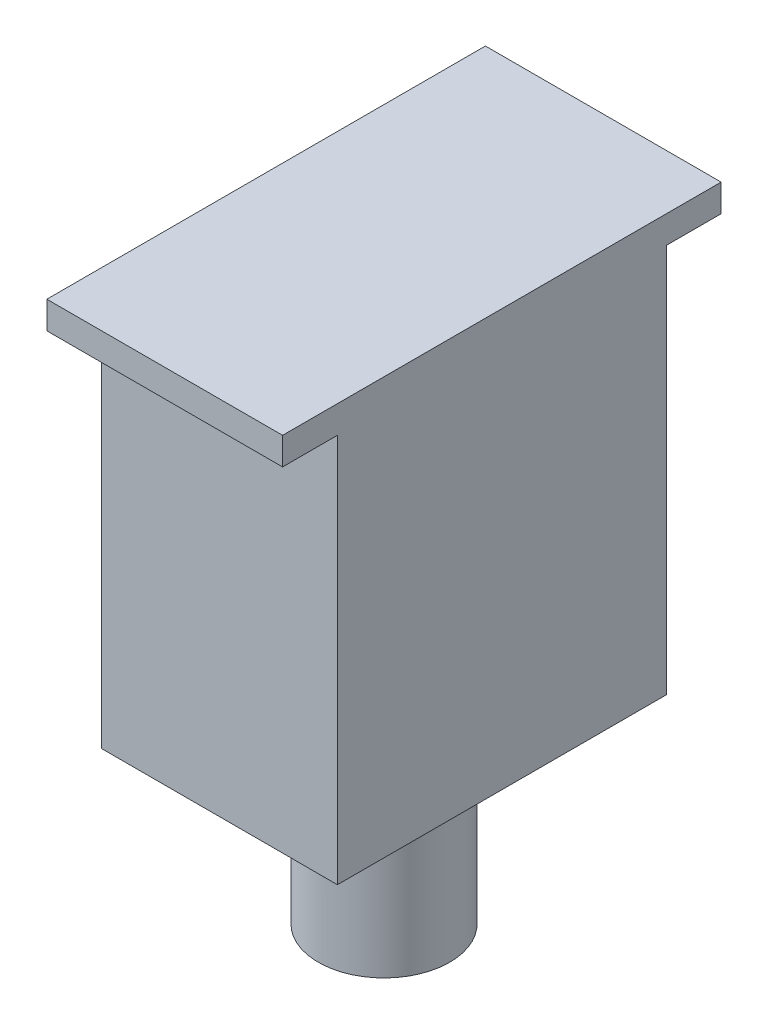
ISO-10303-21;
HEADER;
FILE_DESCRIPTION(('STEP AP214'),'2;1');
FILE_NAME('part.step','',(''),(''),'','','');
FILE_SCHEMA(('AUTOMOTIVE_DESIGN { 1 0 10303 214 1 1 1 1 }'));
ENDSEC;
DATA;
#1=APPLICATION_CONTEXT('core data for automotive mechanical design processes');
#2=APPLICATION_PROTOCOL_DEFINITION('international standard','automotive_design',2000,#1);
#3=PRODUCT_CONTEXT('',#1,'mechanical');
#4=PRODUCT('Part','Part','',(#3));
#5=PRODUCT_RELATED_PRODUCT_CATEGORY('part','',(#4));
#6=PRODUCT_DEFINITION_FORMATION('','',#4);
#7=PRODUCT_DEFINITION_CONTEXT('part definition',#1,'design');
#8=PRODUCT_DEFINITION('design','',#6,#7);
#9=PRODUCT_DEFINITION_SHAPE('','',#8);
#10=(LENGTH_UNIT() NAMED_UNIT(*) SI_UNIT(.MILLI.,.METRE.));
#11=(NAMED_UNIT(*) PLANE_ANGLE_UNIT() SI_UNIT($,.RADIAN.));
#12=(NAMED_UNIT(*) SI_UNIT($,.STERADIAN.) SOLID_ANGLE_UNIT());
#13=UNCERTAINTY_MEASURE_WITH_UNIT(LENGTH_MEASURE(1.E-05),#10,'distance_accuracy_value','');
#14=(GEOMETRIC_REPRESENTATION_CONTEXT(3) GLOBAL_UNCERTAINTY_ASSIGNED_CONTEXT((#13)) GLOBAL_UNIT_ASSIGNED_CONTEXT((#10,
#11,#12)) REPRESENTATION_CONTEXT('',''));
#15=CARTESIAN_POINT('',(0.,0.,0.));
#16=DIRECTION('',(0.,0.,1.));
#17=DIRECTION('',(1.,0.,0.));
#18=AXIS2_PLACEMENT_3D('',#15,#16,#17);
#19=CARTESIAN_POINT('',(465.,-7.6,59.5));
#20=DIRECTION('',(0.,-1.,0.));
#21=DIRECTION('',(0.,0.,-1.));
#22=AXIS2_PLACEMENT_3D('',#19,#20,#21);
#23=PLANE('',#22);
#24=DIRECTION('',(-1.,0.,0.));
#25=VECTOR('',#24,1.);
#26=CARTESIAN_POINT('',(486.5,-7.6,89.5));
#27=LINE('',#26,#25);
#28=CARTESIAN_POINT('',(486.5,-7.6,89.5));
#29=VERTEX_POINT('',#28);
#30=CARTESIAN_POINT('',(443.5,-7.6,89.5));
#31=VERTEX_POINT('',#30);
#32=EDGE_CURVE('E34',#29,#31,#27,.T.);
#33=ORIENTED_EDGE('',*,*,#32,.F.);
#34=DIRECTION('',(0.,0.,1.));
#35=VECTOR('',#34,1.);
#36=CARTESIAN_POINT('',(486.5,-7.6,19.5));
#37=LINE('',#36,#35);
#38=CARTESIAN_POINT('',(486.5,-7.6,99.5));
#39=VERTEX_POINT('',#38);
#40=EDGE_CURVE('E131',#29,#39,#37,.T.);
#41=ORIENTED_EDGE('',*,*,#40,.T.);
#42=DIRECTION('',(-1.,0.,0.));
#43=VECTOR('',#42,1.);
#44=CARTESIAN_POINT('',(486.5,-7.6,99.5));
#45=LINE('',#44,#43);
#46=CARTESIAN_POINT('',(443.5,-7.6,99.5));
#47=VERTEX_POINT('',#46);
#48=EDGE_CURVE('E100',#39,#47,#45,.T.);
#49=ORIENTED_EDGE('',*,*,#48,.T.);
#50=DIRECTION('',(0.,0.,-1.));
#51=VECTOR('',#50,1.);
#52=CARTESIAN_POINT('',(443.5,-7.6,99.5));
#53=LINE('',#52,#51);
#54=EDGE_CURVE('E117',#47,#31,#53,.T.);
#55=ORIENTED_EDGE('',*,*,#54,.T.);
#56=EDGE_LOOP('',(#33,#41,#49,#55));
#57=FACE_BOUND('',#56,.T.);
#58=ADVANCED_FACE('F17',(#57),#23,.T.);
#59=CARTESIAN_POINT('',(443.5,-7.6,99.5));
#60=DIRECTION('',(1.,0.,0.));
#61=DIRECTION('',(0.,0.,-1.));
#62=AXIS2_PLACEMENT_3D('',#59,#60,#61);
#63=PLANE('',#62);
#64=DIRECTION('',(0.,0.,-1.));
#65=VECTOR('',#64,1.);
#66=CARTESIAN_POINT('',(443.5,-2.6,99.5));
#67=LINE('',#66,#65);
#68=CARTESIAN_POINT('',(443.5,-2.6,99.5));
#69=VERTEX_POINT('',#68);
#70=CARTESIAN_POINT('',(443.5,-2.6,19.5));
#71=VERTEX_POINT('',#70);
#72=EDGE_CURVE('E90',#69,#71,#67,.T.);
#73=ORIENTED_EDGE('',*,*,#72,.T.);
#74=DIRECTION('',(0.,1.,0.));
#75=VECTOR('',#74,1.);
#76=CARTESIAN_POINT('',(443.5,-7.6,19.5));
#77=LINE('',#76,#75);
#78=CARTESIAN_POINT('',(443.5,-7.6,19.5));
#79=VERTEX_POINT('',#78);
#80=EDGE_CURVE('E11',#79,#71,#77,.T.);
#81=ORIENTED_EDGE('',*,*,#80,.F.);
#82=CARTESIAN_POINT('',(443.5,-7.6,29.5));
#83=VERTEX_POINT('',#82);
#84=EDGE_CURVE('E94',#83,#79,#53,.T.);
#85=ORIENTED_EDGE('',*,*,#84,.F.);
#86=DIRECTION('',(0.,1.,0.));
#87=VECTOR('',#86,1.);
#88=CARTESIAN_POINT('',(443.5,-31.1,29.5));
#89=LINE('',#88,#87);
#90=CARTESIAN_POINT('',(443.5,-78.6,29.5));
#91=VERTEX_POINT('',#90);
#92=EDGE_CURVE('E114',#91,#83,#89,.T.);
#93=ORIENTED_EDGE('',*,*,#92,.F.);
#94=DIRECTION('',(0.,0.,-1.));
#95=VECTOR('',#94,1.);
#96=CARTESIAN_POINT('',(443.5,-78.6,89.5));
#97=LINE('',#96,#95);
#98=CARTESIAN_POINT('',(443.5,-78.6,89.5));
#99=VERTEX_POINT('',#98);
#100=EDGE_CURVE('E169',#99,#91,#97,.T.);
#101=ORIENTED_EDGE('',*,*,#100,.F.);
#102=DIRECTION('',(0.,1.,0.));
#103=VECTOR('',#102,1.);
#104=CARTESIAN_POINT('',(443.5,-31.1,89.5));
#105=LINE('',#104,#103);
#106=EDGE_CURVE('E151',#99,#31,#105,.T.);
#107=ORIENTED_EDGE('',*,*,#106,.T.);
#108=ORIENTED_EDGE('',*,*,#54,.F.);
#109=DIRECTION('',(0.,1.,0.));
#110=VECTOR('',#109,1.);
#111=CARTESIAN_POINT('',(443.5,-7.6,99.5));
#112=LINE('',#111,#110);
#113=EDGE_CURVE('E102',#47,#69,#112,.T.);
#114=ORIENTED_EDGE('',*,*,#113,.T.);
#115=EDGE_LOOP('',(#73,#81,#85,#93,#101,#107,#108,#114));
#116=FACE_BOUND('',#115,.T.);
#117=ADVANCED_FACE('F19',(#116),#63,.F.);
#118=CARTESIAN_POINT('',(443.5,-7.6,19.5));
#119=DIRECTION('',(0.,0.,1.));
#120=DIRECTION('',(1.,0.,0.));
#121=AXIS2_PLACEMENT_3D('',#118,#119,#120);
#122=PLANE('',#121);
#123=DIRECTION('',(1.,0.,0.));
#124=VECTOR('',#123,1.);
#125=CARTESIAN_POINT('',(443.5,-2.6,19.5));
#126=LINE('',#125,#124);
#127=CARTESIAN_POINT('',(486.5,-2.6,19.5));
#128=VERTEX_POINT('',#127);
#129=EDGE_CURVE('E108',#71,#128,#126,.T.);
#130=ORIENTED_EDGE('',*,*,#129,.T.);
#131=DIRECTION('',(0.,1.,0.));
#132=VECTOR('',#131,1.);
#133=CARTESIAN_POINT('',(486.5,-7.6,19.5));
#134=LINE('',#133,#132);
#135=CARTESIAN_POINT('',(486.5,-7.6,19.5));
#136=VERTEX_POINT('',#135);
#137=EDGE_CURVE('E26',#136,#128,#134,.T.);
#138=ORIENTED_EDGE('',*,*,#137,.F.);
#139=DIRECTION('',(1.,0.,0.));
#140=VECTOR('',#139,1.);
#141=CARTESIAN_POINT('',(443.5,-7.6,19.5));
#142=LINE('',#141,#140);
#143=EDGE_CURVE('E119',#79,#136,#142,.T.);
#144=ORIENTED_EDGE('',*,*,#143,.F.);
#145=ORIENTED_EDGE('',*,*,#80,.T.);
#146=EDGE_LOOP('',(#130,#138,#144,#145));
#147=FACE_BOUND('',#146,.T.);
#148=ADVANCED_FACE('F137',(#147),#122,.F.);
#149=CARTESIAN_POINT('',(486.5,-7.6,19.5));
#150=DIRECTION('',(-1.,0.,0.));
#151=DIRECTION('',(0.,0.,1.));
#152=AXIS2_PLACEMENT_3D('',#149,#150,#151);
#153=PLANE('',#152);
#154=DIRECTION('',(0.,0.,1.));
#155=VECTOR('',#154,1.);
#156=CARTESIAN_POINT('',(486.5,-2.6,19.5));
#157=LINE('',#156,#155);
#158=CARTESIAN_POINT('',(486.5,-2.6,99.5));
#159=VERTEX_POINT('',#158);
#160=EDGE_CURVE('E87',#128,#159,#157,.T.);
#161=ORIENTED_EDGE('',*,*,#160,.T.);
#162=DIRECTION('',(0.,1.,0.));
#163=VECTOR('',#162,1.);
#164=CARTESIAN_POINT('',(486.5,-7.6,99.5));
#165=LINE('',#164,#163);
#166=EDGE_CURVE('E98',#39,#159,#165,.T.);
#167=ORIENTED_EDGE('',*,*,#166,.F.);
#168=ORIENTED_EDGE('',*,*,#40,.F.);
#169=DIRECTION('',(0.,1.,0.));
#170=VECTOR('',#169,1.);
#171=CARTESIAN_POINT('',(486.5,-31.1,89.5));
#172=LINE('',#171,#170);
#173=CARTESIAN_POINT('',(486.5,-78.6,89.5));
#174=VERTEX_POINT('',#173);
#175=EDGE_CURVE('E146',#174,#29,#172,.T.);
#176=ORIENTED_EDGE('',*,*,#175,.F.);
#177=DIRECTION('',(0.,0.,1.));
#178=VECTOR('',#177,1.);
#179=CARTESIAN_POINT('',(486.5,-78.6,29.5));
#180=LINE('',#179,#178);
#181=CARTESIAN_POINT('',(486.5,-78.6,29.5));
#182=VERTEX_POINT('',#181);
#183=EDGE_CURVE('E142',#182,#174,#180,.T.);
#184=ORIENTED_EDGE('',*,*,#183,.F.);
#185=DIRECTION('',(0.,1.,0.));
#186=VECTOR('',#185,1.);
#187=CARTESIAN_POINT('',(486.5,-31.1,29.5));
#188=LINE('',#187,#186);
#189=CARTESIAN_POINT('',(486.5,-7.6,29.5));
#190=VERTEX_POINT('',#189);
#191=EDGE_CURVE('E140',#182,#190,#188,.T.);
#192=ORIENTED_EDGE('',*,*,#191,.T.);
#193=EDGE_CURVE('E125',#136,#190,#37,.T.);
#194=ORIENTED_EDGE('',*,*,#193,.F.);
#195=ORIENTED_EDGE('',*,*,#137,.T.);
#196=EDGE_LOOP('',(#161,#167,#168,#176,#184,#192,#194,#195));
#197=FACE_BOUND('',#196,.T.);
#198=ADVANCED_FACE('F105',(#197),#153,.F.);
#199=CARTESIAN_POINT('',(486.5,-7.6,99.5));
#200=DIRECTION('',(0.,0.,-1.));
#201=DIRECTION('',(-1.,0.,0.));
#202=AXIS2_PLACEMENT_3D('',#199,#200,#201);
#203=PLANE('',#202);
#204=DIRECTION('',(-1.,0.,0.));
#205=VECTOR('',#204,1.);
#206=CARTESIAN_POINT('',(486.5,-2.6,99.5));
#207=LINE('',#206,#205);
#208=EDGE_CURVE('E83',#159,#69,#207,.T.);
#209=ORIENTED_EDGE('',*,*,#208,.T.);
#210=ORIENTED_EDGE('',*,*,#113,.F.);
#211=ORIENTED_EDGE('',*,*,#48,.F.);
#212=ORIENTED_EDGE('',*,*,#166,.T.);
#213=EDGE_LOOP('',(#209,#210,#211,#212));
#214=FACE_BOUND('',#213,.T.);
#215=ADVANCED_FACE('F99',(#214),#203,.F.);
#216=DIRECTION('',(1.,0.,0.));
#217=VECTOR('',#216,1.);
#218=CARTESIAN_POINT('',(443.5,-7.6,29.5));
#219=LINE('',#218,#217);
#220=EDGE_CURVE('E42',#83,#190,#219,.T.);
#221=ORIENTED_EDGE('',*,*,#220,.F.);
#222=ORIENTED_EDGE('',*,*,#84,.T.);
#223=ORIENTED_EDGE('',*,*,#143,.T.);
#224=ORIENTED_EDGE('',*,*,#193,.T.);
#225=EDGE_LOOP('',(#221,#222,#223,#224));
#226=FACE_BOUND('',#225,.T.);
#227=ADVANCED_FACE('F134',(#226),#23,.T.);
#228=CARTESIAN_POINT('',(443.5,-31.1,29.5));
#229=DIRECTION('',(0.,0.,1.));
#230=DIRECTION('',(1.,0.,0.));
#231=AXIS2_PLACEMENT_3D('',#228,#229,#230);
#232=PLANE('',#231);
#233=ORIENTED_EDGE('',*,*,#220,.T.);
#234=ORIENTED_EDGE('',*,*,#191,.F.);
#235=DIRECTION('',(1.,0.,0.));
#236=VECTOR('',#235,1.);
#237=CARTESIAN_POINT('',(443.5,-78.6,29.5));
#238=LINE('',#237,#236);
#239=EDGE_CURVE('E172',#91,#182,#238,.T.);
#240=ORIENTED_EDGE('',*,*,#239,.F.);
#241=ORIENTED_EDGE('',*,*,#92,.T.);
#242=EDGE_LOOP('',(#233,#234,#240,#241));
#243=FACE_BOUND('',#242,.T.);
#244=ADVANCED_FACE('F202',(#243),#232,.F.);
#245=CARTESIAN_POINT('',(486.5,-31.1,89.5));
#246=DIRECTION('',(0.,0.,-1.));
#247=DIRECTION('',(-1.,0.,0.));
#248=AXIS2_PLACEMENT_3D('',#245,#246,#247);
#249=PLANE('',#248);
#250=ORIENTED_EDGE('',*,*,#32,.T.);
#251=ORIENTED_EDGE('',*,*,#106,.F.);
#252=DIRECTION('',(-1.,0.,0.));
#253=VECTOR('',#252,1.);
#254=CARTESIAN_POINT('',(486.5,-78.6,89.5));
#255=LINE('',#254,#253);
#256=EDGE_CURVE('E166',#174,#99,#255,.T.);
#257=ORIENTED_EDGE('',*,*,#256,.F.);
#258=ORIENTED_EDGE('',*,*,#175,.T.);
#259=EDGE_LOOP('',(#250,#251,#257,#258));
#260=FACE_BOUND('',#259,.T.);
#261=ADVANCED_FACE('F207',(#260),#249,.F.);
#262=CARTESIAN_POINT('',(465.,-78.6,59.5));
#263=DIRECTION('',(0.,-1.,0.));
#264=DIRECTION('',(1.,0.,0.));
#265=AXIS2_PLACEMENT_3D('',#262,#263,#264);
#266=PLANE('',#265);
#267=CARTESIAN_POINT('',(465.,-78.6,59.5));
#268=DIRECTION('',(0.,-1.,0.));
#269=DIRECTION('',(1.,0.,0.));
#270=AXIS2_PLACEMENT_3D('',#267,#268,#269);
#271=CIRCLE('',#270,12.);
#272=CARTESIAN_POINT('',(477.,-78.6,59.5));
#273=VERTEX_POINT('',#272);
#274=EDGE_CURVE('E163',#273,#273,#271,.T.);
#275=ORIENTED_EDGE('',*,*,#274,.F.);
#276=EDGE_LOOP('',(#275));
#277=FACE_BOUND('',#276,.T.);
#278=ORIENTED_EDGE('',*,*,#256,.T.);
#279=ORIENTED_EDGE('',*,*,#100,.T.);
#280=ORIENTED_EDGE('',*,*,#239,.T.);
#281=ORIENTED_EDGE('',*,*,#183,.T.);
#282=EDGE_LOOP('',(#278,#279,#280,#281));
#283=FACE_BOUND('',#282,.T.);
#284=ADVANCED_FACE('F191',(#277,#283),#266,.T.);
#285=CARTESIAN_POINT('',(465.,-110.6,59.5));
#286=DIRECTION('',(0.,1.,0.));
#287=DIRECTION('',(-1.,0.,0.));
#288=AXIS2_PLACEMENT_3D('',#285,#286,#287);
#289=CYLINDRICAL_SURFACE('',#288,12.);
#290=CARTESIAN_POINT('',(465.,-110.6,59.5));
#291=DIRECTION('',(0.,1.,0.));
#292=DIRECTION('',(0.,0.,-1.));
#293=AXIS2_PLACEMENT_3D('',#290,#291,#292);
#294=CIRCLE('',#293,12.);
#295=CARTESIAN_POINT('',(465.,-110.6,47.5));
#296=VERTEX_POINT('',#295);
#297=EDGE_CURVE('E170',#296,#296,#294,.T.);
#298=ORIENTED_EDGE('',*,*,#297,.T.);
#299=EDGE_LOOP('',(#298));
#300=FACE_BOUND('',#299,.T.);
#301=ORIENTED_EDGE('',*,*,#274,.T.);
#302=EDGE_LOOP('',(#301));
#303=FACE_BOUND('',#302,.T.);
#304=ADVANCED_FACE('F179',(#300,#303),#289,.T.);
#305=CARTESIAN_POINT('',(465.,-110.6,59.5));
#306=DIRECTION('',(0.,1.,0.));
#307=DIRECTION('',(-1.,0.,0.));
#308=AXIS2_PLACEMENT_3D('',#305,#306,#307);
#309=PLANE('',#308);
#310=ORIENTED_EDGE('',*,*,#297,.F.);
#311=EDGE_LOOP('',(#310));
#312=FACE_BOUND('',#311,.T.);
#313=ADVANCED_FACE('F182',(#312),#309,.F.);
#314=CARTESIAN_POINT('',(0.,-2.6,0.));
#315=DIRECTION('',(0.,1.,0.));
#316=DIRECTION('',(0.,0.,1.));
#317=AXIS2_PLACEMENT_3D('',#314,#315,#316);
#318=PLANE('',#317);
#319=ORIENTED_EDGE('',*,*,#72,.F.);
#320=ORIENTED_EDGE('',*,*,#208,.F.);
#321=ORIENTED_EDGE('',*,*,#160,.F.);
#322=ORIENTED_EDGE('',*,*,#129,.F.);
#323=EDGE_LOOP('',(#319,#320,#321,#322));
#324=FACE_BOUND('',#323,.T.);
#325=ADVANCED_FACE('F85',(#324),#318,.T.);
#326=CLOSED_SHELL('',(#58,#117,#148,#198,#215,#227,#244,#261,#284,#304,#313,#325));
#327=MANIFOLD_SOLID_BREP('B1',#326);
#328=ADVANCED_BREP_SHAPE_REPRESENTATION('',(#18,#327),#14);
#329=SHAPE_DEFINITION_REPRESENTATION(#9,#328);
ENDSEC;
END-ISO-10303-21;
